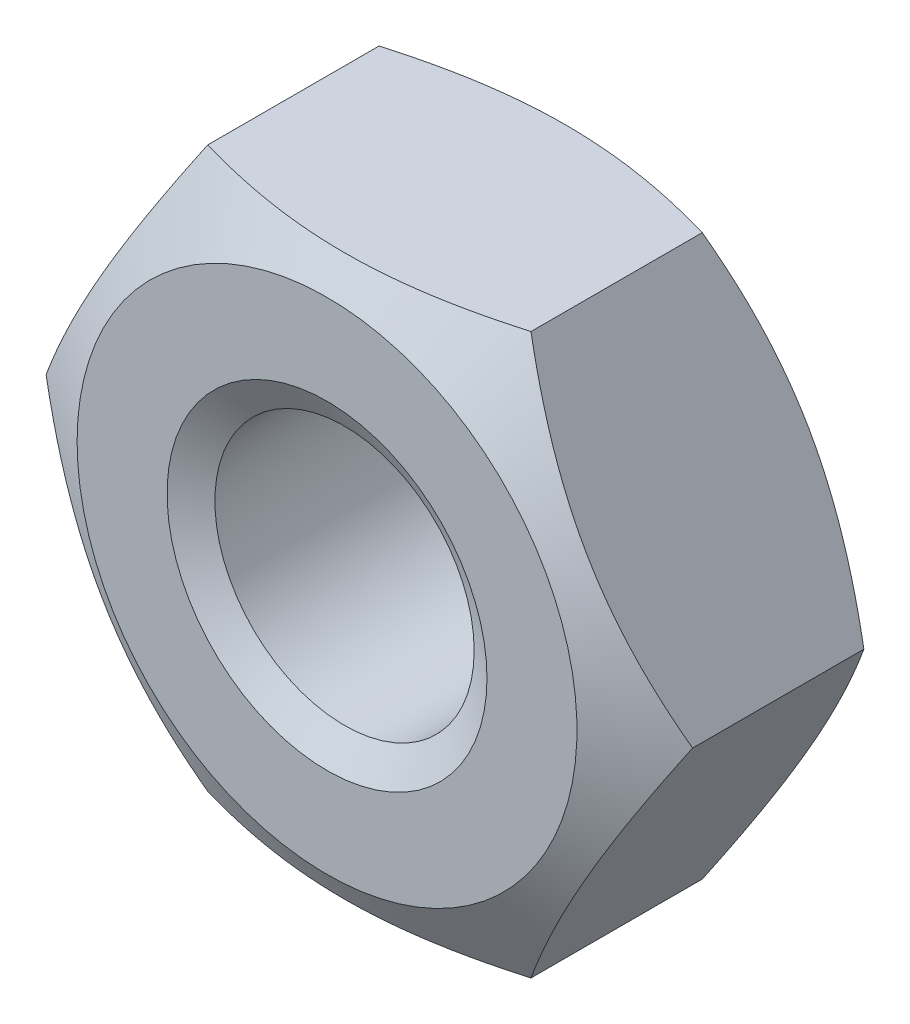
ISO-10303-21;
HEADER;
FILE_DESCRIPTION(('STEP AP214'),'2;1');
FILE_NAME('part.step','',(''),(''),'','','');
FILE_SCHEMA(('AUTOMOTIVE_DESIGN { 1 0 10303 214 1 1 1 1 }'));
ENDSEC;
DATA;
#1=APPLICATION_CONTEXT('core data for automotive mechanical design processes');
#2=APPLICATION_PROTOCOL_DEFINITION('international standard','automotive_design',2000,#1);
#3=PRODUCT_CONTEXT('',#1,'mechanical');
#4=PRODUCT('Part','Part','',(#3));
#5=PRODUCT_RELATED_PRODUCT_CATEGORY('part','',(#4));
#6=PRODUCT_DEFINITION_FORMATION('','',#4);
#7=PRODUCT_DEFINITION_CONTEXT('part definition',#1,'design');
#8=PRODUCT_DEFINITION('design','',#6,#7);
#9=PRODUCT_DEFINITION_SHAPE('','',#8);
#10=(LENGTH_UNIT() NAMED_UNIT(*) SI_UNIT(.MILLI.,.METRE.));
#11=(NAMED_UNIT(*) PLANE_ANGLE_UNIT() SI_UNIT($,.RADIAN.));
#12=(NAMED_UNIT(*) SI_UNIT($,.STERADIAN.) SOLID_ANGLE_UNIT());
#13=UNCERTAINTY_MEASURE_WITH_UNIT(LENGTH_MEASURE(1.E-05),#10,'distance_accuracy_value','');
#14=(GEOMETRIC_REPRESENTATION_CONTEXT(3) GLOBAL_UNCERTAINTY_ASSIGNED_CONTEXT((#13)) GLOBAL_UNIT_ASSIGNED_CONTEXT((#10,
#11,#12)) REPRESENTATION_CONTEXT('',''));
#15=CARTESIAN_POINT('',(0.,0.,0.));
#16=DIRECTION('',(0.,0.,1.));
#17=DIRECTION('',(1.,0.,0.));
#18=AXIS2_PLACEMENT_3D('',#15,#16,#17);
#19=CARTESIAN_POINT('',(2.02072594216369,-3.5,-3.2));
#20=DIRECTION('',(0.866025403784439,-0.5,0.));
#21=DIRECTION('',(0.5,0.866025403784439,0.));
#22=AXIS2_PLACEMENT_3D('',#19,#20,#21);
#23=PLANE('',#22);
#24=CARTESIAN_POINT('',(2.02061047210985,-3.5002,-0.529180411639473));
#25=CARTESIAN_POINT('',(2.10941108799267,-3.34639282154755,-0.477892139936086));
#26=CARTESIAN_POINT('',(2.19897822522909,-3.19125798916558,-0.4312473047623));
#27=CARTESIAN_POINT('',(2.37966345361545,-2.87830199342322,-0.349828226479453));
#28=CARTESIAN_POINT('',(2.47078475532382,-2.72047526921251,-0.315082786530666));
#29=CARTESIAN_POINT('',(2.65189807961073,-2.40677778961987,-0.260996378128941));
#30=CARTESIAN_POINT('',(2.74186223545399,-2.25095530083931,-0.241295437206487));
#31=CARTESIAN_POINT('',(2.92221386641055,-1.93857711279463,-0.21777648368336));
#32=CARTESIAN_POINT('',(3.01260068598001,-1.78202254896577,-0.213938995491671));
#33=CARTESIAN_POINT('',(3.1814939814933,-1.48949078007901,-0.221921652823083));
#34=CARTESIAN_POINT('',(3.26002573814992,-1.3534697875421,-0.231781785015712));
#35=CARTESIAN_POINT('',(3.41657761679353,-1.08231397971101,-0.263032817845508));
#36=CARTESIAN_POINT('',(3.49459719728457,-0.947180102315318,-0.284434394231903));
#37=CARTESIAN_POINT('',(3.65147186489428,-0.675465207594817,-0.337936758826681));
#38=CARTESIAN_POINT('',(3.73030709667643,-0.538918580721665,-0.37026434539119));
#39=CARTESIAN_POINT('',(3.88680174018324,-0.267861907055499,-0.443635284754097));
#40=CARTESIAN_POINT('',(3.96446315689009,-0.133348387531463,-0.484661397515969));
#41=CARTESIAN_POINT('',(4.04156735438122,0.000200000000000456,-0.529180411639473));
#42=B_SPLINE_CURVE_WITH_KNOTS('',3,(#24,#25,#26,#27,#28,#29,#30,#31,#32,#33,#34,#35,#36,#37,#38,
#39,#40,#41),.UNSPECIFIED.,.F.,.F.,(4,2,2,2,2,2,2,2,4),(0.,0.554793832886253,1.11092123814983,
1.65328467083218,2.19498204478403,2.6666513085086,3.13875761298267,3.62133612600509,
4.10296698719187),.UNSPECIFIED.);
#43=CARTESIAN_POINT('',(2.0207259421637,-3.5,-0.529113742115747));
#44=VERTEX_POINT('',#43);
#45=CARTESIAN_POINT('',(4.04145188432738,0.,-0.529113742115747));
#46=VERTEX_POINT('',#45);
#47=EDGE_CURVE('E52',#44,#46,#42,.T.);
#48=ORIENTED_EDGE('',*,*,#47,.F.);
#49=DIRECTION('',(0.,0.,1.));
#50=VECTOR('',#49,1.);
#51=CARTESIAN_POINT('',(2.02072594216369,-3.5,-3.2));
#52=LINE('',#51,#50);
#53=CARTESIAN_POINT('',(2.0207259421637,-3.5,-2.67088625788425));
#54=VERTEX_POINT('',#53);
#55=EDGE_CURVE('E116',#54,#44,#52,.T.);
#56=ORIENTED_EDGE('',*,*,#55,.F.);
#57=CARTESIAN_POINT('',(4.04156735438122,0.000200000000000645,-2.67081958836053));
#58=CARTESIAN_POINT('',(3.9527667384984,-0.153607178452449,-2.72210786006391));
#59=CARTESIAN_POINT('',(3.86319960126198,-0.308742010834423,-2.7687526952377));
#60=CARTESIAN_POINT('',(3.68251437287562,-0.62169800657678,-2.85017177352055));
#61=CARTESIAN_POINT('',(3.59139307116725,-0.779524730787494,-2.88491721346933));
#62=CARTESIAN_POINT('',(3.41027974688034,-1.09322221038013,-2.93900362187106));
#63=CARTESIAN_POINT('',(3.32031559103708,-1.24904469916069,-2.95870456279351));
#64=CARTESIAN_POINT('',(3.13996396008051,-1.56142288720537,-2.98222351631664));
#65=CARTESIAN_POINT('',(3.04957714051106,-1.71797745103423,-2.98606100450833));
#66=CARTESIAN_POINT('',(2.88068384499777,-2.01050921992099,-2.97807834717692));
#67=CARTESIAN_POINT('',(2.80215208834114,-2.1465302124579,-2.96821821498429));
#68=CARTESIAN_POINT('',(2.64560020969753,-2.41768602028899,-2.93696718215449));
#69=CARTESIAN_POINT('',(2.5675806292065,-2.55281989768468,-2.9155656057681));
#70=CARTESIAN_POINT('',(2.41070596159678,-2.82453479240518,-2.86206324117332));
#71=CARTESIAN_POINT('',(2.33187072981463,-2.96108141927834,-2.82973565460881));
#72=CARTESIAN_POINT('',(2.17537608630783,-3.2321380929445,-2.7563647152459));
#73=CARTESIAN_POINT('',(2.09771466960098,-3.36665161246854,-2.71533860248403));
#74=CARTESIAN_POINT('',(2.02061047210985,-3.5002,-2.67081958836053));
#75=B_SPLINE_CURVE_WITH_KNOTS('',3,(#57,#58,#59,#60,#61,#62,#63,#64,#65,#66,#67,#68,#69,#70,#71,
#72,#73,#74),.UNSPECIFIED.,.F.,.F.,(4,2,2,2,2,2,2,2,4),(0.,0.554793832886253,1.11092123814983,
1.65328467083218,2.19498204478403,2.6666513085086,3.13875761298267,3.6213361260051,
4.10296698719187),.UNSPECIFIED.);
#76=CARTESIAN_POINT('',(4.04145188432738,0.,-2.67088625788425));
#77=VERTEX_POINT('',#76);
#78=EDGE_CURVE('E127',#77,#54,#75,.T.);
#79=ORIENTED_EDGE('',*,*,#78,.F.);
#80=DIRECTION('',(0.,0.,1.));
#81=VECTOR('',#80,1.);
#82=CARTESIAN_POINT('',(4.04145188432738,0.,-3.2));
#83=LINE('',#82,#81);
#84=EDGE_CURVE('E124',#77,#46,#83,.T.);
#85=ORIENTED_EDGE('',*,*,#84,.T.);
#86=EDGE_LOOP('',(#48,#56,#79,#85));
#87=FACE_BOUND('',#86,.T.);
#88=ADVANCED_FACE('F37',(#87),#23,.T.);
#89=CARTESIAN_POINT('',(-2.02072594216369,-3.5,-3.2));
#90=DIRECTION('',(0.,-1.,0.));
#91=DIRECTION('',(0.,0.,-1.));
#92=AXIS2_PLACEMENT_3D('',#89,#90,#91);
#93=PLANE('',#92);
#94=CARTESIAN_POINT('',(-5.32929161654317,-3.5,-1.87687395708917));
#95=CARTESIAN_POINT('',(-5.17721390419067,-3.5,-1.80350487565994));
#96=CARTESIAN_POINT('',(-5.02477626878264,-3.5,-1.73086848506458));
#97=CARTESIAN_POINT('',(-4.71898932740942,-3.5,-1.58747532667976));
#98=CARTESIAN_POINT('',(-4.56563987275511,-3.5,-1.51671887634277));
#99=CARTESIAN_POINT('',(-4.25699896893402,-3.5,-1.37712246688467));
#100=CARTESIAN_POINT('',(-4.10170141817195,-3.5,-1.30829594937782));
#101=CARTESIAN_POINT('',(-3.78983593684866,-3.5,-1.17359495846103));
#102=CARTESIAN_POINT('',(-3.63326806987044,-3.5,-1.10772033836364));
#103=CARTESIAN_POINT('',(-3.31397317950403,-3.5,-0.977818284434954));
#104=CARTESIAN_POINT('',(-3.1512005381005,-3.5,-0.913902341259745));
#105=CARTESIAN_POINT('',(-2.82371486391853,-3.5,-0.79115117758084));
#106=CARTESIAN_POINT('',(-2.65900161073452,-3.5,-0.732316540634471));
#107=CARTESIAN_POINT('',(-2.32771428220496,-3.5,-0.621345152712524));
#108=CARTESIAN_POINT('',(-2.16114510128922,-3.5,-0.569193942658812));
#109=CARTESIAN_POINT('',(-1.82562056548841,-3.5,-0.473327366020735));
#110=CARTESIAN_POINT('',(-1.65666601191436,-3.5,-0.429609235646829));
#111=CARTESIAN_POINT('',(-1.31718369019152,-3.5,-0.352994778610104));
#112=CARTESIAN_POINT('',(-1.14666839877701,-3.5,-0.320044212866405));
#113=CARTESIAN_POINT('',(-0.803625193118966,-3.5,-0.266896804969145));
#114=CARTESIAN_POINT('',(-0.631097439625843,-3.5,-0.246698951170405));
#115=CARTESIAN_POINT('',(-0.28710102571895,-3.5,-0.220933629162163));
#116=CARTESIAN_POINT('',(-0.115646203361172,-3.5,-0.215185920399921));
#117=CARTESIAN_POINT('',(0.227139625218219,-3.5,-0.218339385870476));
#118=CARTESIAN_POINT('',(0.398470626767779,-3.5,-0.227241086659771));
#119=CARTESIAN_POINT('',(0.692349454668638,-3.5,-0.254460230236954));
#120=CARTESIAN_POINT('',(0.815219779623653,-3.5,-0.269472731531103));
#121=CARTESIAN_POINT('',(1.05998960023957,-3.5,-0.306041966480247));
#122=CARTESIAN_POINT('',(1.18188894833212,-3.5,-0.327599676106086));
#123=CARTESIAN_POINT('',(1.54600794183218,-3.5,-0.400949728847912));
#124=CARTESIAN_POINT('',(1.78649842940784,-3.5,-0.461403324209748));
#125=CARTESIAN_POINT('',(2.14599672793668,-3.5,-0.565325828456278));
#126=CARTESIAN_POINT('',(2.26688905461166,-3.5,-0.602639268070146));
#127=CARTESIAN_POINT('',(2.50749825220121,-3.5,-0.680914127688239));
#128=CARTESIAN_POINT('',(2.62721511556065,-3.5,-0.721875571122514));
#129=CARTESIAN_POINT('',(2.86551603325762,-3.5,-0.806808159344165));
#130=CARTESIAN_POINT('',(2.98410049564077,-3.5,-0.850778169507659));
#131=CARTESIAN_POINT('',(3.22030222157322,-3.5,-0.941233650119845));
#132=CARTESIAN_POINT('',(3.3379194941164,-3.5,-0.987719097146951));
#133=CARTESIAN_POINT('',(3.60516917076278,-3.5,-1.0961149969147));
#134=CARTESIAN_POINT('',(3.75452937337451,-3.5,-1.15869521360348));
#135=CARTESIAN_POINT('',(4.05207329899395,-3.5,-1.28659848230968));
#136=CARTESIAN_POINT('',(4.20025696630694,-3.5,-1.35192166326358));
#137=CARTESIAN_POINT('',(4.64337511466969,-3.5,-1.55119395905422));
#138=CARTESIAN_POINT('',(4.93683132147272,-3.5,-1.68842699826337));
#139=CARTESIAN_POINT('',(5.52118834963182,-3.5,-1.96881056529261));
#140=CARTESIAN_POINT('',(5.81208673092351,-3.5,-2.11196612775264));
#141=CARTESIAN_POINT('',(6.39186182499708,-3.5,-2.40232740634392));
#142=CARTESIAN_POINT('',(6.68073847267516,-3.5,-2.54953325215636));
#143=CARTESIAN_POINT('',(7.23458971232226,-3.5,-2.83528891126869));
#144=CARTESIAN_POINT('',(7.49967651839816,-3.5,-2.97362193479787));
#145=CARTESIAN_POINT('',(8.02887233478434,-3.5,-3.25216194114253));
#146=CARTESIAN_POINT('',(8.29298131705417,-3.5,-3.39236897717446));
#147=CARTESIAN_POINT('',(8.81986478760678,-3.5,-3.67392059382426));
#148=CARTESIAN_POINT('',(9.08264092219005,-3.5,-3.81526209803125));
#149=CARTESIAN_POINT('',(9.60756200304195,-3.5,-4.09908318288291));
#150=CARTESIAN_POINT('',(9.86970697868872,-3.5,-4.24156270916979));
#151=CARTESIAN_POINT('',(10.1316166656453,-3.5,-4.384470530275));
#152=B_SPLINE_CURVE_WITH_KNOTS('',3,(#94,#95,#96,#97,#98,#99,#100,#101,#102,#103,#104,#105,#106,
#107,#108,#109,#110,#111,#112,#113,#114,#115,#116,#117,#118,#119,#120,#121,#122,#123,#124,#125,
#126,#127,#128,#129,#130,#131,#132,#133,#134,#135,#136,#137,#138,#139,#140,#141,#142,#143,#144,
#145,#146,#147,#148,#149,#150,#151),.UNSPECIFIED.,.F.,.F.,(4,2,2,2,2,2,2,2,2,2,2,2,2,2,2,2,2,2,
2,2,2,2,2,2,2,2,2,2,4),(0.,0.506559628513161,1.01320425947753,1.52277737705162,2.03232514446701,
2.55687533859891,3.08148569426823,3.60494121554562,4.12822489117061,4.64883048977565,
5.16939478466903,5.68343298488776,6.19748966203318,6.56865983361145,6.93988537841949,
7.68278720969736,8.06231738593603,8.44184999996057,8.82124026108465,9.20062699026042,
9.68641258908992,10.1722210484987,11.143985405014,12.1165935360882,13.0892328442636,
13.986254382616,14.8833014480957,15.7784288466341,16.673513741979),.UNSPECIFIED.);
#153=CARTESIAN_POINT('',(-2.02072594216369,-3.5,-0.529113742115747));
#154=VERTEX_POINT('',#153);
#155=EDGE_CURVE('E109',#154,#44,#152,.T.);
#156=ORIENTED_EDGE('',*,*,#155,.F.);
#157=DIRECTION('',(0.,0.,1.));
#158=VECTOR('',#157,1.);
#159=CARTESIAN_POINT('',(-2.02072594216369,-3.5,-3.2));
#160=LINE('',#159,#158);
#161=CARTESIAN_POINT('',(-2.02072594216369,-3.5,-2.67088625788425));
#162=VERTEX_POINT('',#161);
#163=EDGE_CURVE('E108',#162,#154,#160,.T.);
#164=ORIENTED_EDGE('',*,*,#163,.F.);
#165=CARTESIAN_POINT('',(-5.32929161654317,-3.5,-1.32312604291083));
#166=CARTESIAN_POINT('',(-5.17721390419067,-3.5,-1.39649512434006));
#167=CARTESIAN_POINT('',(-5.02477626878264,-3.5,-1.46913151493542));
#168=CARTESIAN_POINT('',(-4.71898932740942,-3.5,-1.61252467332024));
#169=CARTESIAN_POINT('',(-4.56563987275511,-3.5,-1.68328112365723));
#170=CARTESIAN_POINT('',(-4.25699896893402,-3.5,-1.82287753311533));
#171=CARTESIAN_POINT('',(-4.10170141817195,-3.5,-1.89170405062218));
#172=CARTESIAN_POINT('',(-3.78983593684866,-3.5,-2.02640504153897));
#173=CARTESIAN_POINT('',(-3.63326806987044,-3.5,-2.09227966163636));
#174=CARTESIAN_POINT('',(-3.31397317950403,-3.5,-2.22218171556505));
#175=CARTESIAN_POINT('',(-3.1512005381005,-3.5,-2.28609765874026));
#176=CARTESIAN_POINT('',(-2.82371486391853,-3.5,-2.40884882241916));
#177=CARTESIAN_POINT('',(-2.65900161073452,-3.5,-2.46768345936553));
#178=CARTESIAN_POINT('',(-2.32771428220496,-3.5,-2.57865484728748));
#179=CARTESIAN_POINT('',(-2.16114510128922,-3.5,-2.63080605734119));
#180=CARTESIAN_POINT('',(-1.82562056548841,-3.5,-2.72667263397926));
#181=CARTESIAN_POINT('',(-1.65666601191436,-3.5,-2.77039076435317));
#182=CARTESIAN_POINT('',(-1.31718369019152,-3.5,-2.8470052213899));
#183=CARTESIAN_POINT('',(-1.14666839877701,-3.5,-2.8799557871336));
#184=CARTESIAN_POINT('',(-0.803625193118966,-3.5,-2.93310319503086));
#185=CARTESIAN_POINT('',(-0.631097439625843,-3.5,-2.9533010488296));
#186=CARTESIAN_POINT('',(-0.287101025718951,-3.5,-2.97906637083784));
#187=CARTESIAN_POINT('',(-0.115646203361172,-3.5,-2.98481407960008));
#188=CARTESIAN_POINT('',(0.227139625218219,-3.5,-2.98166061412952));
#189=CARTESIAN_POINT('',(0.398470626767779,-3.5,-2.97275891334023));
#190=CARTESIAN_POINT('',(0.692349454668638,-3.5,-2.94553976976305));
#191=CARTESIAN_POINT('',(0.815219779623654,-3.5,-2.9305272684689));
#192=CARTESIAN_POINT('',(1.05998960023957,-3.5,-2.89395803351975));
#193=CARTESIAN_POINT('',(1.18188894833212,-3.5,-2.87240032389391));
#194=CARTESIAN_POINT('',(1.54600794183218,-3.5,-2.79905027115209));
#195=CARTESIAN_POINT('',(1.78649842940784,-3.5,-2.73859667579025));
#196=CARTESIAN_POINT('',(2.14599672793668,-3.5,-2.63467417154372));
#197=CARTESIAN_POINT('',(2.26688905461166,-3.5,-2.59736073192985));
#198=CARTESIAN_POINT('',(2.50749825220121,-3.5,-2.51908587231176));
#199=CARTESIAN_POINT('',(2.62721511556065,-3.5,-2.47812442887749));
#200=CARTESIAN_POINT('',(2.86551603325762,-3.5,-2.39319184065584));
#201=CARTESIAN_POINT('',(2.98410049564077,-3.5,-2.34922183049234));
#202=CARTESIAN_POINT('',(3.22030222157322,-3.5,-2.25876634988016));
#203=CARTESIAN_POINT('',(3.3379194941164,-3.5,-2.21228090285305));
#204=CARTESIAN_POINT('',(3.60516917076278,-3.5,-2.1038850030853));
#205=CARTESIAN_POINT('',(3.75452937337451,-3.5,-2.04130478639653));
#206=CARTESIAN_POINT('',(4.05207329899395,-3.5,-1.91340151769032));
#207=CARTESIAN_POINT('',(4.20025696630694,-3.5,-1.84807833673642));
#208=CARTESIAN_POINT('',(4.64337511466969,-3.5,-1.64880604094578));
#209=CARTESIAN_POINT('',(4.93683132147271,-3.5,-1.51157300173663));
#210=CARTESIAN_POINT('',(5.52118834963182,-3.5,-1.23118943470739));
#211=CARTESIAN_POINT('',(5.81208673092351,-3.5,-1.08803387224736));
#212=CARTESIAN_POINT('',(6.39186182499708,-3.5,-0.797672593656079));
#213=CARTESIAN_POINT('',(6.68073847267516,-3.5,-0.65046674784364));
#214=CARTESIAN_POINT('',(7.23458971232226,-3.5,-0.364711088731306));
#215=CARTESIAN_POINT('',(7.49967651839816,-3.5,-0.226378065202127));
#216=CARTESIAN_POINT('',(8.02887233478434,-3.5,0.05216194114253));
#217=CARTESIAN_POINT('',(8.29298131705417,-3.5,0.192368977174463));
#218=CARTESIAN_POINT('',(8.81986478760678,-3.5,0.473920593824257));
#219=CARTESIAN_POINT('',(9.08264092219005,-3.5,0.615262098031252));
#220=CARTESIAN_POINT('',(9.60756200304195,-3.5,0.899083182882905));
#221=CARTESIAN_POINT('',(9.86970697868872,-3.5,1.04156270916979));
#222=CARTESIAN_POINT('',(10.1316166656453,-3.5,1.184470530275));
#223=B_SPLINE_CURVE_WITH_KNOTS('',3,(#165,#166,#167,#168,#169,#170,#171,#172,#173,#174,#175,
#176,#177,#178,#179,#180,#181,#182,#183,#184,#185,#186,#187,#188,#189,#190,#191,#192,#193,#194,
#195,#196,#197,#198,#199,#200,#201,#202,#203,#204,#205,#206,#207,#208,#209,#210,#211,#212,#213,
#214,#215,#216,#217,#218,#219,#220,#221,#222),.UNSPECIFIED.,.F.,.F.,(4,2,2,2,2,2,2,2,2,2,2,2,2,
2,2,2,2,2,2,2,2,2,2,2,2,2,2,2,4),(0.,0.506559628513161,1.01320425947753,1.52277737705162,
2.03232514446701,2.55687533859891,3.08148569426823,3.60494121554561,4.12822489117061,
4.64883048977565,5.16939478466903,5.68343298488776,6.19748966203318,6.56865983361145,
6.93988537841949,7.68278720969736,8.06231738593602,8.44184999996057,8.82124026108465,
9.20062699026042,9.68641258908991,10.1722210484987,11.143985405014,12.1165935360882,
13.0892328442636,13.986254382616,14.8833014480957,15.7784288466341,16.673513741979),.UNSPECIFIED.);
#224=EDGE_CURVE('E203',#54,#162,#223,.F.);
#225=ORIENTED_EDGE('',*,*,#224,.F.);
#226=ORIENTED_EDGE('',*,*,#55,.T.);
#227=EDGE_LOOP('',(#156,#164,#225,#226));
#228=FACE_BOUND('',#227,.T.);
#229=ADVANCED_FACE('F213',(#228),#93,.T.);
#230=CARTESIAN_POINT('',(-4.04145188432738,0.,-3.2));
#231=DIRECTION('',(-0.866025403784439,-0.5,0.));
#232=DIRECTION('',(0.5,-0.866025403784439,0.));
#233=AXIS2_PLACEMENT_3D('',#230,#231,#232);
#234=PLANE('',#233);
#235=CARTESIAN_POINT('',(-4.04156735438122,0.000200000000001303,-0.529180411639475));
#236=CARTESIAN_POINT('',(-3.9527667384984,-0.153607178452448,-0.477892139936088));
#237=CARTESIAN_POINT('',(-3.86319960126198,-0.308742010834423,-0.431247304762302));
#238=CARTESIAN_POINT('',(-3.68251437287562,-0.62169800657678,-0.349828226479454));
#239=CARTESIAN_POINT('',(-3.59139307116725,-0.779524730787494,-0.315082786530667));
#240=CARTESIAN_POINT('',(-3.41027974688034,-1.09322221038013,-0.260996378128943));
#241=CARTESIAN_POINT('',(-3.32031559103708,-1.24904469916069,-0.241295437206488));
#242=CARTESIAN_POINT('',(-3.13996396008052,-1.56142288720537,-0.217776483683361));
#243=CARTESIAN_POINT('',(-3.04957714051106,-1.71797745103423,-0.213938995491672));
#244=CARTESIAN_POINT('',(-2.88068384499778,-2.01050921992099,-0.221921652823084));
#245=CARTESIAN_POINT('',(-2.80215208834115,-2.1465302124579,-0.231781785015713));
#246=CARTESIAN_POINT('',(-2.64560020969754,-2.41768602028899,-0.263032817845509));
#247=CARTESIAN_POINT('',(-2.5675806292065,-2.55281989768468,-0.284434394231903));
#248=CARTESIAN_POINT('',(-2.41070596159679,-2.82453479240518,-0.337936758826682));
#249=CARTESIAN_POINT('',(-2.33187072981464,-2.96108141927833,-0.370264345391191));
#250=CARTESIAN_POINT('',(-2.17537608630783,-3.2321380929445,-0.443635284754098));
#251=CARTESIAN_POINT('',(-2.09771466960098,-3.36665161246854,-0.48466139751597));
#252=CARTESIAN_POINT('',(-2.02061047210985,-3.5002,-0.529180411639473));
#253=B_SPLINE_CURVE_WITH_KNOTS('',3,(#235,#236,#237,#238,#239,#240,#241,#242,#243,#244,#245,
#246,#247,#248,#249,#250,#251,#252),.UNSPECIFIED.,.F.,.F.,(4,2,2,2,2,2,2,2,4),(0.,
0.554793832886253,1.11092123814984,1.65328467083219,2.19498204478403,2.6666513085086,
3.13875761298267,3.6213361260051,4.10296698719187),.UNSPECIFIED.);
#254=CARTESIAN_POINT('',(-4.04145188432738,0.,-0.529113742115747));
#255=VERTEX_POINT('',#254);
#256=EDGE_CURVE('E92',#255,#154,#253,.T.);
#257=ORIENTED_EDGE('',*,*,#256,.F.);
#258=DIRECTION('',(0.,0.,1.));
#259=VECTOR('',#258,1.);
#260=CARTESIAN_POINT('',(-4.04145188432738,0.,-3.2));
#261=LINE('',#260,#259);
#262=CARTESIAN_POINT('',(-4.04145188432738,0.,-2.67088625788425));
#263=VERTEX_POINT('',#262);
#264=EDGE_CURVE('E106',#263,#255,#261,.T.);
#265=ORIENTED_EDGE('',*,*,#264,.F.);
#266=CARTESIAN_POINT('',(-2.02061047210985,-3.5002,-2.67081958836053));
#267=CARTESIAN_POINT('',(-2.10941108799267,-3.34639282154755,-2.72210786006391));
#268=CARTESIAN_POINT('',(-2.19897822522909,-3.19125798916558,-2.7687526952377));
#269=CARTESIAN_POINT('',(-2.37966345361545,-2.87830199342322,-2.85017177352055));
#270=CARTESIAN_POINT('',(-2.47078475532382,-2.7204752692125,-2.88491721346933));
#271=CARTESIAN_POINT('',(-2.65189807961073,-2.40677778961987,-2.93900362187106));
#272=CARTESIAN_POINT('',(-2.74186223545399,-2.25095530083931,-2.95870456279351));
#273=CARTESIAN_POINT('',(-2.92221386641056,-1.93857711279463,-2.98222351631664));
#274=CARTESIAN_POINT('',(-3.01260068598001,-1.78202254896577,-2.98606100450833));
#275=CARTESIAN_POINT('',(-3.1814939814933,-1.48949078007901,-2.97807834717692));
#276=CARTESIAN_POINT('',(-3.26002573814993,-1.3534697875421,-2.96821821498429));
#277=CARTESIAN_POINT('',(-3.41657761679354,-1.08231397971101,-2.93696718215449));
#278=CARTESIAN_POINT('',(-3.49459719728458,-0.947180102315318,-2.9155656057681));
#279=CARTESIAN_POINT('',(-3.65147186489429,-0.675465207594816,-2.86206324117332));
#280=CARTESIAN_POINT('',(-3.73030709667644,-0.538918580721664,-2.82973565460881));
#281=CARTESIAN_POINT('',(-3.88680174018324,-0.267861907055498,-2.7563647152459));
#282=CARTESIAN_POINT('',(-3.96446315689009,-0.133348387531462,-2.71533860248403));
#283=CARTESIAN_POINT('',(-4.04156735438122,0.000200000000001482,-2.67081958836053));
#284=B_SPLINE_CURVE_WITH_KNOTS('',3,(#266,#267,#268,#269,#270,#271,#272,#273,#274,#275,#276,
#277,#278,#279,#280,#281,#282,#283),.UNSPECIFIED.,.F.,.F.,(4,2,2,2,2,2,2,2,4),(0.,
0.554793832886253,1.11092123814983,1.65328467083218,2.19498204478403,2.6666513085086,
3.13875761298267,3.6213361260051,4.10296698719187),.UNSPECIFIED.);
#285=EDGE_CURVE('E196',#162,#263,#284,.T.);
#286=ORIENTED_EDGE('',*,*,#285,.F.);
#287=ORIENTED_EDGE('',*,*,#163,.T.);
#288=EDGE_LOOP('',(#257,#265,#286,#287));
#289=FACE_BOUND('',#288,.T.);
#290=ADVANCED_FACE('F104',(#289),#234,.T.);
#291=CARTESIAN_POINT('',(-2.02072594216369,3.5,-3.2));
#292=DIRECTION('',(-0.866025403784438,0.5,0.));
#293=DIRECTION('',(-0.5,-0.866025403784439,0.));
#294=AXIS2_PLACEMENT_3D('',#291,#292,#293);
#295=PLANE('',#294);
#296=CARTESIAN_POINT('',(-2.02061047210985,3.5002,-0.529180411639474));
#297=CARTESIAN_POINT('',(-2.10941108799267,3.34639282154755,-0.477892139936087));
#298=CARTESIAN_POINT('',(-2.19897822522909,3.19125798916558,-0.431247304762301));
#299=CARTESIAN_POINT('',(-2.37966345361545,2.87830199342322,-0.349828226479454));
#300=CARTESIAN_POINT('',(-2.47078475532382,2.72047526921251,-0.315082786530668));
#301=CARTESIAN_POINT('',(-2.65189807961074,2.40677778961987,-0.260996378128943));
#302=CARTESIAN_POINT('',(-2.74186223545399,2.25095530083931,-0.241295437206488));
#303=CARTESIAN_POINT('',(-2.92221386641056,1.93857711279463,-0.217776483683361));
#304=CARTESIAN_POINT('',(-3.01260068598001,1.78202254896577,-0.213938995491673));
#305=CARTESIAN_POINT('',(-3.1814939814933,1.48949078007901,-0.221921652823085));
#306=CARTESIAN_POINT('',(-3.26002573814993,1.3534697875421,-0.231781785015714));
#307=CARTESIAN_POINT('',(-3.41657761679354,1.08231397971101,-0.26303281784551));
#308=CARTESIAN_POINT('',(-3.49459719728458,0.947180102315319,-0.284434394231905));
#309=CARTESIAN_POINT('',(-3.65147186489429,0.675465207594818,-0.337936758826683));
#310=CARTESIAN_POINT('',(-3.73030709667644,0.538918580721666,-0.370264345391192));
#311=CARTESIAN_POINT('',(-3.88680174018324,0.2678619070555,-0.443635284754099));
#312=CARTESIAN_POINT('',(-3.96446315689009,0.133348387531465,-0.484661397515971));
#313=CARTESIAN_POINT('',(-4.04156735438122,-0.000199999999998752,-0.529180411639475));
#314=B_SPLINE_CURVE_WITH_KNOTS('',3,(#296,#297,#298,#299,#300,#301,#302,#303,#304,#305,#306,
#307,#308,#309,#310,#311,#312,#313),.UNSPECIFIED.,.F.,.F.,(4,2,2,2,2,2,2,2,4),(0.,
0.554793832886253,1.11092123814984,1.65328467083218,2.19498204478403,2.6666513085086,
3.13875761298267,3.62133612600509,4.10296698719187),.UNSPECIFIED.);
#315=CARTESIAN_POINT('',(-2.02072594216369,3.5,-0.529113742115747));
#316=VERTEX_POINT('',#315);
#317=EDGE_CURVE('E88',#316,#255,#314,.T.);
#318=ORIENTED_EDGE('',*,*,#317,.F.);
#319=DIRECTION('',(0.,0.,1.));
#320=VECTOR('',#319,1.);
#321=CARTESIAN_POINT('',(-2.02072594216369,3.5,-3.2));
#322=LINE('',#321,#320);
#323=CARTESIAN_POINT('',(-2.02072594216369,3.5,-2.67088625788425));
#324=VERTEX_POINT('',#323);
#325=EDGE_CURVE('E114',#324,#316,#322,.T.);
#326=ORIENTED_EDGE('',*,*,#325,.F.);
#327=CARTESIAN_POINT('',(-4.04156735438122,-0.00019999999999875,-2.67081958836053));
#328=CARTESIAN_POINT('',(-3.9527667384984,0.153607178452451,-2.72210786006391));
#329=CARTESIAN_POINT('',(-3.86319960126198,0.308742010834425,-2.7687526952377));
#330=CARTESIAN_POINT('',(-3.68251437287562,0.621698006576782,-2.85017177352055));
#331=CARTESIAN_POINT('',(-3.59139307116725,0.779524730787497,-2.88491721346933));
#332=CARTESIAN_POINT('',(-3.41027974688034,1.09322221038013,-2.93900362187106));
#333=CARTESIAN_POINT('',(-3.32031559103708,1.24904469916069,-2.95870456279351));
#334=CARTESIAN_POINT('',(-3.13996396008052,1.56142288720537,-2.98222351631664));
#335=CARTESIAN_POINT('',(-3.04957714051106,1.71797745103423,-2.98606100450833));
#336=CARTESIAN_POINT('',(-2.88068384499778,2.01050921992099,-2.97807834717692));
#337=CARTESIAN_POINT('',(-2.80215208834115,2.14653021245791,-2.96821821498429));
#338=CARTESIAN_POINT('',(-2.64560020969754,2.41768602028899,-2.93696718215449));
#339=CARTESIAN_POINT('',(-2.5675806292065,2.55281989768468,-2.9155656057681));
#340=CARTESIAN_POINT('',(-2.41070596159679,2.82453479240518,-2.86206324117332));
#341=CARTESIAN_POINT('',(-2.33187072981464,2.96108141927834,-2.82973565460881));
#342=CARTESIAN_POINT('',(-2.17537608630783,3.2321380929445,-2.7563647152459));
#343=CARTESIAN_POINT('',(-2.09771466960099,3.36665161246854,-2.71533860248403));
#344=CARTESIAN_POINT('',(-2.02061047210985,3.5002,-2.67081958836053));
#345=B_SPLINE_CURVE_WITH_KNOTS('',3,(#327,#328,#329,#330,#331,#332,#333,#334,#335,#336,#337,
#338,#339,#340,#341,#342,#343,#344),.UNSPECIFIED.,.F.,.F.,(4,2,2,2,2,2,2,2,4),(0.,
0.554793832886253,1.11092123814984,1.65328467083219,2.19498204478403,2.6666513085086,
3.13875761298267,3.62133612600509,4.10296698719187),.UNSPECIFIED.);
#346=EDGE_CURVE('E113',#263,#324,#345,.T.);
#347=ORIENTED_EDGE('',*,*,#346,.F.);
#348=ORIENTED_EDGE('',*,*,#264,.T.);
#349=EDGE_LOOP('',(#318,#326,#347,#348));
#350=FACE_BOUND('',#349,.T.);
#351=ADVANCED_FACE('F112',(#350),#295,.T.);
#352=CARTESIAN_POINT('',(2.02072594216369,3.5,-3.2));
#353=DIRECTION('',(0.,1.,0.));
#354=DIRECTION('',(0.,0.,1.));
#355=AXIS2_PLACEMENT_3D('',#352,#353,#354);
#356=PLANE('',#355);
#357=CARTESIAN_POINT('',(-5.32929161654318,3.5,-1.87687395708917));
#358=CARTESIAN_POINT('',(-5.17721390419067,3.5,-1.80350487565994));
#359=CARTESIAN_POINT('',(-5.02477626878264,3.5,-1.73086848506458));
#360=CARTESIAN_POINT('',(-4.71898932740942,3.5,-1.58747532667976));
#361=CARTESIAN_POINT('',(-4.56563987275511,3.5,-1.51671887634277));
#362=CARTESIAN_POINT('',(-4.25699896893402,3.5,-1.37712246688467));
#363=CARTESIAN_POINT('',(-4.10170141817195,3.5,-1.30829594937782));
#364=CARTESIAN_POINT('',(-3.78983593684866,3.5,-1.17359495846103));
#365=CARTESIAN_POINT('',(-3.63326806987044,3.5,-1.10772033836364));
#366=CARTESIAN_POINT('',(-3.31397317950403,3.5,-0.977818284434954));
#367=CARTESIAN_POINT('',(-3.1512005381005,3.5,-0.913902341259745));
#368=CARTESIAN_POINT('',(-2.82371486391854,3.5,-0.791151177580841));
#369=CARTESIAN_POINT('',(-2.65900161073452,3.5,-0.732316540634472));
#370=CARTESIAN_POINT('',(-2.32771428220496,3.5,-0.621345152712525));
#371=CARTESIAN_POINT('',(-2.16114510128923,3.5,-0.569193942658812));
#372=CARTESIAN_POINT('',(-1.82562056548841,3.5,-0.473327366020736));
#373=CARTESIAN_POINT('',(-1.65666601191436,3.5,-0.42960923564683));
#374=CARTESIAN_POINT('',(-1.31718369019152,3.5,-0.352994778610105));
#375=CARTESIAN_POINT('',(-1.14666839877701,3.5,-0.320044212866406));
#376=CARTESIAN_POINT('',(-0.803625193118967,3.5,-0.266896804969146));
#377=CARTESIAN_POINT('',(-0.631097439625844,3.5,-0.246698951170405));
#378=CARTESIAN_POINT('',(-0.287101025718951,3.5,-0.220933629162164));
#379=CARTESIAN_POINT('',(-0.115646203361172,3.5,-0.215185920399921));
#380=CARTESIAN_POINT('',(0.227139625218218,3.5,-0.218339385870476));
#381=CARTESIAN_POINT('',(0.398470626767778,3.5,-0.227241086659771));
#382=CARTESIAN_POINT('',(0.692349454668638,3.5,-0.254460230236955));
#383=CARTESIAN_POINT('',(0.815219779623653,3.5,-0.269472731531103));
#384=CARTESIAN_POINT('',(1.05998960023957,3.5,-0.306041966480247));
#385=CARTESIAN_POINT('',(1.18188894833212,3.5,-0.327599676106087));
#386=CARTESIAN_POINT('',(1.54600794183218,3.5,-0.400949728847912));
#387=CARTESIAN_POINT('',(1.78649842940784,3.5,-0.461403324209749));
#388=CARTESIAN_POINT('',(2.14599672793668,3.5,-0.565325828456279));
#389=CARTESIAN_POINT('',(2.26688905461166,3.5,-0.602639268070146));
#390=CARTESIAN_POINT('',(2.50749825220121,3.5,-0.680914127688239));
#391=CARTESIAN_POINT('',(2.62721511556065,3.5,-0.721875571122515));
#392=CARTESIAN_POINT('',(2.86551603325762,3.5,-0.806808159344166));
#393=CARTESIAN_POINT('',(2.98410049564077,3.5,-0.85077816950766));
#394=CARTESIAN_POINT('',(3.22030222157322,3.5,-0.941233650119846));
#395=CARTESIAN_POINT('',(3.33791949411641,3.5,-0.987719097146952));
#396=CARTESIAN_POINT('',(3.60516917076278,3.5,-1.0961149969147));
#397=CARTESIAN_POINT('',(3.75452937337451,3.5,-1.15869521360348));
#398=CARTESIAN_POINT('',(4.05207329899395,3.5,-1.28659848230968));
#399=CARTESIAN_POINT('',(4.20025696630694,3.5,-1.35192166326358));
#400=CARTESIAN_POINT('',(4.64337511466969,3.5,-1.55119395905422));
#401=CARTESIAN_POINT('',(4.93683132147271,3.5,-1.68842699826337));
#402=CARTESIAN_POINT('',(5.52118834963182,3.5,-1.96881056529261));
#403=CARTESIAN_POINT('',(5.81208673092351,3.5,-2.11196612775264));
#404=CARTESIAN_POINT('',(6.39186182499707,3.5,-2.40232740634392));
#405=CARTESIAN_POINT('',(6.68073847267516,3.5,-2.54953325215636));
#406=CARTESIAN_POINT('',(7.23458971232226,3.5,-2.83528891126869));
#407=CARTESIAN_POINT('',(7.49967651839815,3.5,-2.97362193479787));
#408=CARTESIAN_POINT('',(8.02887233478433,3.5,-3.25216194114253));
#409=CARTESIAN_POINT('',(8.29298131705417,3.5,-3.39236897717446));
#410=CARTESIAN_POINT('',(8.81986478760678,3.5,-3.67392059382426));
#411=CARTESIAN_POINT('',(9.08264092219005,3.5,-3.81526209803125));
#412=CARTESIAN_POINT('',(9.60756200304195,3.5,-4.09908318288291));
#413=CARTESIAN_POINT('',(9.86970697868872,3.5,-4.24156270916979));
#414=CARTESIAN_POINT('',(10.1316166656453,3.5,-4.384470530275));
#415=B_SPLINE_CURVE_WITH_KNOTS('',3,(#357,#358,#359,#360,#361,#362,#363,#364,#365,#366,#367,
#368,#369,#370,#371,#372,#373,#374,#375,#376,#377,#378,#379,#380,#381,#382,#383,#384,#385,#386,
#387,#388,#389,#390,#391,#392,#393,#394,#395,#396,#397,#398,#399,#400,#401,#402,#403,#404,#405,
#406,#407,#408,#409,#410,#411,#412,#413,#414),.UNSPECIFIED.,.F.,.F.,(4,2,2,2,2,2,2,2,2,2,2,2,2,
2,2,2,2,2,2,2,2,2,2,2,2,2,2,2,4),(0.,0.506559628513162,1.01320425947753,1.52277737705162,
2.03232514446701,2.55687533859891,3.08148569426823,3.60494121554562,4.12822489117061,
4.64883048977565,5.16939478466903,5.68343298488776,6.19748966203318,6.56865983361145,
6.9398853784195,7.68278720969736,8.06231738593603,8.44184999996057,8.82124026108466,
9.20062699026042,9.68641258908992,10.1722210484987,11.143985405014,12.1165935360882,
13.0892328442636,13.9862543826159,14.8833014480957,15.7784288466341,16.673513741979),.UNSPECIFIED.);
#416=CARTESIAN_POINT('',(2.02072594216368,3.50000000000001,-0.529113742115747));
#417=VERTEX_POINT('',#416);
#418=EDGE_CURVE('E95',#417,#316,#415,.F.);
#419=ORIENTED_EDGE('',*,*,#418,.F.);
#420=DIRECTION('',(0.,0.,1.));
#421=VECTOR('',#420,1.);
#422=CARTESIAN_POINT('',(2.02072594216369,3.5,-3.2));
#423=LINE('',#422,#421);
#424=CARTESIAN_POINT('',(2.02072594216369,3.5,-2.67088625788426));
#425=VERTEX_POINT('',#424);
#426=EDGE_CURVE('E118',#425,#417,#423,.T.);
#427=ORIENTED_EDGE('',*,*,#426,.F.);
#428=CARTESIAN_POINT('',(-5.32929161654318,3.5,-1.32312604291083));
#429=CARTESIAN_POINT('',(-5.17721390419067,3.5,-1.39649512434006));
#430=CARTESIAN_POINT('',(-5.02477626878264,3.5,-1.46913151493542));
#431=CARTESIAN_POINT('',(-4.71898932740942,3.5,-1.61252467332024));
#432=CARTESIAN_POINT('',(-4.56563987275511,3.5,-1.68328112365723));
#433=CARTESIAN_POINT('',(-4.25699896893402,3.5,-1.82287753311533));
#434=CARTESIAN_POINT('',(-4.10170141817195,3.5,-1.89170405062218));
#435=CARTESIAN_POINT('',(-3.78983593684866,3.5,-2.02640504153897));
#436=CARTESIAN_POINT('',(-3.63326806987044,3.5,-2.09227966163636));
#437=CARTESIAN_POINT('',(-3.31397317950403,3.5,-2.22218171556505));
#438=CARTESIAN_POINT('',(-3.1512005381005,3.5,-2.28609765874026));
#439=CARTESIAN_POINT('',(-2.82371486391854,3.5,-2.40884882241916));
#440=CARTESIAN_POINT('',(-2.65900161073452,3.5,-2.46768345936553));
#441=CARTESIAN_POINT('',(-2.32771428220496,3.5,-2.57865484728748));
#442=CARTESIAN_POINT('',(-2.16114510128923,3.5,-2.63080605734119));
#443=CARTESIAN_POINT('',(-1.82562056548841,3.5,-2.72667263397926));
#444=CARTESIAN_POINT('',(-1.65666601191436,3.5,-2.77039076435317));
#445=CARTESIAN_POINT('',(-1.31718369019152,3.5,-2.8470052213899));
#446=CARTESIAN_POINT('',(-1.14666839877701,3.5,-2.8799557871336));
#447=CARTESIAN_POINT('',(-0.803625193118967,3.5,-2.93310319503085));
#448=CARTESIAN_POINT('',(-0.631097439625844,3.5,-2.9533010488296));
#449=CARTESIAN_POINT('',(-0.287101025718951,3.5,-2.97906637083784));
#450=CARTESIAN_POINT('',(-0.115646203361172,3.5,-2.98481407960008));
#451=CARTESIAN_POINT('',(0.227139625218218,3.5,-2.98166061412952));
#452=CARTESIAN_POINT('',(0.398470626767778,3.5,-2.97275891334023));
#453=CARTESIAN_POINT('',(0.692349454668638,3.5,-2.94553976976305));
#454=CARTESIAN_POINT('',(0.815219779623653,3.5,-2.9305272684689));
#455=CARTESIAN_POINT('',(1.05998960023957,3.5,-2.89395803351975));
#456=CARTESIAN_POINT('',(1.18188894833212,3.5,-2.87240032389391));
#457=CARTESIAN_POINT('',(1.54600794183218,3.5,-2.79905027115209));
#458=CARTESIAN_POINT('',(1.78649842940784,3.5,-2.73859667579025));
#459=CARTESIAN_POINT('',(2.14599672793668,3.5,-2.63467417154372));
#460=CARTESIAN_POINT('',(2.26688905461166,3.5,-2.59736073192985));
#461=CARTESIAN_POINT('',(2.50749825220121,3.5,-2.51908587231176));
#462=CARTESIAN_POINT('',(2.62721511556065,3.5,-2.47812442887749));
#463=CARTESIAN_POINT('',(2.86551603325762,3.5,-2.39319184065584));
#464=CARTESIAN_POINT('',(2.98410049564077,3.5,-2.34922183049234));
#465=CARTESIAN_POINT('',(3.22030222157322,3.5,-2.25876634988015));
#466=CARTESIAN_POINT('',(3.33791949411641,3.5,-2.21228090285305));
#467=CARTESIAN_POINT('',(3.60516917076278,3.5,-2.1038850030853));
#468=CARTESIAN_POINT('',(3.75452937337451,3.5,-2.04130478639653));
#469=CARTESIAN_POINT('',(4.05207329899395,3.5,-1.91340151769032));
#470=CARTESIAN_POINT('',(4.20025696630694,3.5,-1.84807833673642));
#471=CARTESIAN_POINT('',(4.64337511466969,3.5,-1.64880604094578));
#472=CARTESIAN_POINT('',(4.93683132147271,3.5,-1.51157300173663));
#473=CARTESIAN_POINT('',(5.52118834963182,3.5,-1.23118943470739));
#474=CARTESIAN_POINT('',(5.81208673092351,3.5,-1.08803387224736));
#475=CARTESIAN_POINT('',(6.39186182499707,3.5,-0.79767259365608));
#476=CARTESIAN_POINT('',(6.68073847267516,3.5,-0.650466747843641));
#477=CARTESIAN_POINT('',(7.23458971232226,3.5,-0.364711088731307));
#478=CARTESIAN_POINT('',(7.49967651839816,3.5,-0.226378065202127));
#479=CARTESIAN_POINT('',(8.02887233478434,3.5,0.0521619411425301));
#480=CARTESIAN_POINT('',(8.29298131705417,3.5,0.192368977174463));
#481=CARTESIAN_POINT('',(8.81986478760678,3.5,0.473920593824257));
#482=CARTESIAN_POINT('',(9.08264092219005,3.5,0.615262098031252));
#483=CARTESIAN_POINT('',(9.60756200304195,3.5,0.899083182882905));
#484=CARTESIAN_POINT('',(9.86970697868872,3.5,1.04156270916979));
#485=CARTESIAN_POINT('',(10.1316166656453,3.5,1.184470530275));
#486=B_SPLINE_CURVE_WITH_KNOTS('',3,(#428,#429,#430,#431,#432,#433,#434,#435,#436,#437,#438,
#439,#440,#441,#442,#443,#444,#445,#446,#447,#448,#449,#450,#451,#452,#453,#454,#455,#456,#457,
#458,#459,#460,#461,#462,#463,#464,#465,#466,#467,#468,#469,#470,#471,#472,#473,#474,#475,#476,
#477,#478,#479,#480,#481,#482,#483,#484,#485),.UNSPECIFIED.,.F.,.F.,(4,2,2,2,2,2,2,2,2,2,2,2,2,
2,2,2,2,2,2,2,2,2,2,2,2,2,2,2,4),(0.,0.506559628513162,1.01320425947753,1.52277737705162,
2.03232514446701,2.55687533859891,3.08148569426823,3.60494121554562,4.12822489117061,
4.64883048977565,5.16939478466903,5.68343298488776,6.19748966203318,6.56865983361145,
6.9398853784195,7.68278720969736,8.06231738593603,8.44184999996057,8.82124026108466,
9.20062699026042,9.68641258908992,10.1722210484987,11.143985405014,12.1165935360882,
13.0892328442636,13.986254382616,14.8833014480957,15.7784288466341,16.673513741979),.UNSPECIFIED.);
#487=EDGE_CURVE('E60',#324,#425,#486,.T.);
#488=ORIENTED_EDGE('',*,*,#487,.F.);
#489=ORIENTED_EDGE('',*,*,#325,.T.);
#490=EDGE_LOOP('',(#419,#427,#488,#489));
#491=FACE_BOUND('',#490,.T.);
#492=ADVANCED_FACE('F240',(#491),#356,.T.);
#493=CARTESIAN_POINT('',(4.04145188432738,0.,-3.2));
#494=DIRECTION('',(0.866025403784438,0.5,0.));
#495=DIRECTION('',(-0.5,0.866025403784438,0.));
#496=AXIS2_PLACEMENT_3D('',#493,#494,#495);
#497=PLANE('',#496);
#498=CARTESIAN_POINT('',(4.04156735438122,-0.000199999999999393,-0.529180411639473));
#499=CARTESIAN_POINT('',(3.9527667384984,0.15360717845245,-0.477892139936086));
#500=CARTESIAN_POINT('',(3.86319960126198,0.308742010834424,-0.4312473047623));
#501=CARTESIAN_POINT('',(3.68251437287562,0.621698006576781,-0.349828226479453));
#502=CARTESIAN_POINT('',(3.59139307116725,0.779524730787495,-0.315082786530666));
#503=CARTESIAN_POINT('',(3.41027974688034,1.09322221038013,-0.260996378128941));
#504=CARTESIAN_POINT('',(3.32031559103708,1.24904469916069,-0.241295437206487));
#505=CARTESIAN_POINT('',(3.13996396008051,1.56142288720537,-0.21777648368336));
#506=CARTESIAN_POINT('',(3.04957714051106,1.71797745103423,-0.21393899549167));
#507=CARTESIAN_POINT('',(2.88068384499777,2.01050921992099,-0.221921652823083));
#508=CARTESIAN_POINT('',(2.80215208834114,2.1465302124579,-0.231781785015712));
#509=CARTESIAN_POINT('',(2.64560020969753,2.41768602028899,-0.263032817845508));
#510=CARTESIAN_POINT('',(2.56758062920649,2.55281989768468,-0.284434394231902));
#511=CARTESIAN_POINT('',(2.41070596159678,2.82453479240518,-0.33793675882668));
#512=CARTESIAN_POINT('',(2.33187072981463,2.96108141927833,-0.37026434539119));
#513=CARTESIAN_POINT('',(2.17537608630783,3.2321380929445,-0.443635284754096));
#514=CARTESIAN_POINT('',(2.09771466960098,3.36665161246854,-0.484661397515969));
#515=CARTESIAN_POINT('',(2.02061047210985,3.5002,-0.529180411639472));
#516=B_SPLINE_CURVE_WITH_KNOTS('',3,(#498,#499,#500,#501,#502,#503,#504,#505,#506,#507,#508,
#509,#510,#511,#512,#513,#514,#515),.UNSPECIFIED.,.F.,.F.,(4,2,2,2,2,2,2,2,4),(0.,
0.554793832886253,1.11092123814983,1.65328467083218,2.19498204478403,2.6666513085086,
3.13875761298267,3.62133612600509,4.10296698719187),.UNSPECIFIED.);
#517=EDGE_CURVE('E262',#46,#417,#516,.T.);
#518=ORIENTED_EDGE('',*,*,#517,.F.);
#519=ORIENTED_EDGE('',*,*,#84,.F.);
#520=CARTESIAN_POINT('',(2.02061047210985,3.5002,-2.67081958836053));
#521=CARTESIAN_POINT('',(2.10941108799267,3.34639282154755,-2.72210786006391));
#522=CARTESIAN_POINT('',(2.19897822522909,3.19125798916558,-2.7687526952377));
#523=CARTESIAN_POINT('',(2.37966345361545,2.87830199342322,-2.85017177352055));
#524=CARTESIAN_POINT('',(2.47078475532382,2.72047526921251,-2.88491721346933));
#525=CARTESIAN_POINT('',(2.65189807961073,2.40677778961987,-2.93900362187106));
#526=CARTESIAN_POINT('',(2.74186223545399,2.25095530083931,-2.95870456279351));
#527=CARTESIAN_POINT('',(2.92221386641055,1.93857711279463,-2.98222351631664));
#528=CARTESIAN_POINT('',(3.01260068598001,1.78202254896577,-2.98606100450833));
#529=CARTESIAN_POINT('',(3.18149398149329,1.48949078007901,-2.97807834717692));
#530=CARTESIAN_POINT('',(3.26002573814992,1.3534697875421,-2.96821821498429));
#531=CARTESIAN_POINT('',(3.41657761679353,1.08231397971101,-2.93696718215449));
#532=CARTESIAN_POINT('',(3.49459719728457,0.94718010231532,-2.9155656057681));
#533=CARTESIAN_POINT('',(3.65147186489428,0.675465207594818,-2.86206324117332));
#534=CARTESIAN_POINT('',(3.73030709667643,0.538918580721666,-2.82973565460881));
#535=CARTESIAN_POINT('',(3.88680174018324,0.2678619070555,-2.7563647152459));
#536=CARTESIAN_POINT('',(3.96446315689009,0.133348387531465,-2.71533860248403));
#537=CARTESIAN_POINT('',(4.04156735438122,-0.000199999999999091,-2.67081958836053));
#538=B_SPLINE_CURVE_WITH_KNOTS('',3,(#520,#521,#522,#523,#524,#525,#526,#527,#528,#529,#530,
#531,#532,#533,#534,#535,#536,#537),.UNSPECIFIED.,.F.,.F.,(4,2,2,2,2,2,2,2,4),(0.,
0.554793832886253,1.11092123814983,1.65328467083218,2.19498204478403,2.6666513085086,
3.13875761298267,3.62133612600509,4.10296698719187),.UNSPECIFIED.);
#539=EDGE_CURVE('E154',#425,#77,#538,.T.);
#540=ORIENTED_EDGE('',*,*,#539,.F.);
#541=ORIENTED_EDGE('',*,*,#426,.T.);
#542=EDGE_LOOP('',(#518,#519,#540,#541));
#543=FACE_BOUND('',#542,.T.);
#544=ADVANCED_FACE('F148',(#543),#497,.T.);
#545=CARTESIAN_POINT('',(4.04145188432738,0.,-3.2));
#546=DIRECTION('',(0.,0.,1.));
#547=DIRECTION('',(1.,0.,0.));
#548=AXIS2_PLACEMENT_3D('',#545,#546,#547);
#549=PLANE('',#548);
#550=CARTESIAN_POINT('',(0.,0.,-3.2));
#551=DIRECTION('',(0.,0.,1.));
#552=DIRECTION('',(1.,0.,0.));
#553=AXIS2_PLACEMENT_3D('',#550,#551,#552);
#554=CIRCLE('',#553,1.83981575202287);
#555=CARTESIAN_POINT('',(1.83981575202287,0.,-3.2));
#556=VERTEX_POINT('',#555);
#557=EDGE_CURVE('E128',#556,#556,#554,.T.);
#558=ORIENTED_EDGE('',*,*,#557,.T.);
#559=EDGE_LOOP('',(#558));
#560=FACE_BOUND('',#559,.T.);
#561=CARTESIAN_POINT('',(0.,0.,-3.2));
#562=DIRECTION('',(0.,0.,-1.));
#563=DIRECTION('',(-1.,0.,0.));
#564=AXIS2_PLACEMENT_3D('',#561,#562,#563);
#565=CIRCLE('',#564,3.125);
#566=CARTESIAN_POINT('',(-3.125,0.,-3.2));
#567=VERTEX_POINT('',#566);
#568=EDGE_CURVE('E152',#567,#567,#565,.T.);
#569=ORIENTED_EDGE('',*,*,#568,.T.);
#570=EDGE_LOOP('',(#569));
#571=FACE_BOUND('',#570,.T.);
#572=ADVANCED_FACE('F144',(#560,#571),#549,.F.);
#573=CARTESIAN_POINT('',(4.04145188432738,0.,0.));
#574=DIRECTION('',(0.,0.,1.));
#575=DIRECTION('',(1.,0.,0.));
#576=AXIS2_PLACEMENT_3D('',#573,#574,#575);
#577=PLANE('',#576);
#578=CARTESIAN_POINT('',(0.,0.,0.));
#579=DIRECTION('',(0.,0.,1.));
#580=DIRECTION('',(1.,0.,0.));
#581=AXIS2_PLACEMENT_3D('',#578,#579,#580);
#582=CIRCLE('',#581,2.);
#583=CARTESIAN_POINT('',(2.,0.,0.));
#584=VERTEX_POINT('',#583);
#585=EDGE_CURVE('E11',#584,#584,#582,.F.);
#586=ORIENTED_EDGE('',*,*,#585,.T.);
#587=EDGE_LOOP('',(#586));
#588=FACE_BOUND('',#587,.T.);
#589=CARTESIAN_POINT('',(0.,0.,0.));
#590=DIRECTION('',(0.,0.,-1.));
#591=DIRECTION('',(-1.,0.,0.));
#592=AXIS2_PLACEMENT_3D('',#589,#590,#591);
#593=CIRCLE('',#592,3.125);
#594=CARTESIAN_POINT('',(-3.125,0.,0.));
#595=VERTEX_POINT('',#594);
#596=EDGE_CURVE('E263',#595,#595,#593,.T.);
#597=ORIENTED_EDGE('',*,*,#596,.F.);
#598=EDGE_LOOP('',(#597));
#599=FACE_BOUND('',#598,.T.);
#600=ADVANCED_FACE('F147',(#588,#599),#577,.T.);
#601=CARTESIAN_POINT('',(0.,0.,-3.2));
#602=DIRECTION('',(0.,0.,1.));
#603=DIRECTION('',(1.,0.,0.));
#604=AXIS2_PLACEMENT_3D('',#601,#602,#603);
#605=CYLINDRICAL_SURFACE('',#604,1.621);
#606=CARTESIAN_POINT('',(0.,0.,-2.821));
#607=DIRECTION('',(0.,0.,1.));
#608=DIRECTION('',(1.,0.,0.));
#609=AXIS2_PLACEMENT_3D('',#606,#607,#608);
#610=CIRCLE('',#609,1.621);
#611=CARTESIAN_POINT('',(1.621,0.,-2.821));
#612=VERTEX_POINT('',#611);
#613=EDGE_CURVE('E45',#612,#612,#610,.F.);
#614=ORIENTED_EDGE('',*,*,#613,.T.);
#615=EDGE_LOOP('',(#614));
#616=FACE_BOUND('',#615,.T.);
#617=CARTESIAN_POINT('',(0.,0.,-0.218815752022868));
#618=DIRECTION('',(0.,0.,1.));
#619=DIRECTION('',(1.,0.,0.));
#620=AXIS2_PLACEMENT_3D('',#617,#618,#619);
#621=CIRCLE('',#620,1.621);
#622=CARTESIAN_POINT('',(1.621,0.,-0.218815752022868));
#623=VERTEX_POINT('',#622);
#624=EDGE_CURVE('E131',#623,#623,#621,.T.);
#625=ORIENTED_EDGE('',*,*,#624,.T.);
#626=EDGE_LOOP('',(#625));
#627=FACE_BOUND('',#626,.T.);
#628=ADVANCED_FACE('F136',(#616,#627),#605,.F.);
#629=CARTESIAN_POINT('',(0.,0.,-2.67088625788425));
#630=DIRECTION('',(0.,0.,1.));
#631=DIRECTION('',(1.,0.,0.));
#632=AXIS2_PLACEMENT_3D('',#629,#630,#631);
#633=CONICAL_SURFACE('',#632,4.04145188432738,1.0471975511966);
#634=ORIENTED_EDGE('',*,*,#78,.T.);
#635=ORIENTED_EDGE('',*,*,#224,.T.);
#636=ORIENTED_EDGE('',*,*,#285,.T.);
#637=ORIENTED_EDGE('',*,*,#346,.T.);
#638=ORIENTED_EDGE('',*,*,#487,.T.);
#639=ORIENTED_EDGE('',*,*,#539,.T.);
#640=EDGE_LOOP('',(#634,#635,#636,#637,#638,#639));
#641=FACE_BOUND('',#640,.T.);
#642=ORIENTED_EDGE('',*,*,#568,.F.);
#643=EDGE_LOOP('',(#642));
#644=FACE_BOUND('',#643,.T.);
#645=ADVANCED_FACE('F179',(#641,#644),#633,.T.);
#646=CARTESIAN_POINT('',(0.,0.,0.));
#647=DIRECTION('',(0.,0.,-1.));
#648=DIRECTION('',(-1.,0.,0.));
#649=AXIS2_PLACEMENT_3D('',#646,#647,#648);
#650=CONICAL_SURFACE('',#649,3.125,1.0471975511966);
#651=ORIENTED_EDGE('',*,*,#47,.T.);
#652=ORIENTED_EDGE('',*,*,#517,.T.);
#653=ORIENTED_EDGE('',*,*,#418,.T.);
#654=ORIENTED_EDGE('',*,*,#317,.T.);
#655=ORIENTED_EDGE('',*,*,#256,.T.);
#656=ORIENTED_EDGE('',*,*,#155,.T.);
#657=EDGE_LOOP('',(#651,#652,#653,#654,#655,#656));
#658=FACE_BOUND('',#657,.T.);
#659=ORIENTED_EDGE('',*,*,#596,.T.);
#660=EDGE_LOOP('',(#659));
#661=FACE_BOUND('',#660,.T.);
#662=ADVANCED_FACE('F90',(#658,#661),#650,.T.);
#663=CARTESIAN_POINT('',(0.,0.,-3.2));
#664=DIRECTION('',(0.,0.,-1.));
#665=DIRECTION('',(-1.,0.,0.));
#666=AXIS2_PLACEMENT_3D('',#663,#664,#665);
#667=CONICAL_SURFACE('',#666,1.83981575202287,0.523598775598297);
#668=ORIENTED_EDGE('',*,*,#613,.F.);
#669=EDGE_LOOP('',(#668));
#670=FACE_BOUND('',#669,.T.);
#671=ORIENTED_EDGE('',*,*,#557,.F.);
#672=EDGE_LOOP('',(#671));
#673=FACE_BOUND('',#672,.T.);
#674=ADVANCED_FACE('F139',(#670,#673),#667,.F.);
#675=CARTESIAN_POINT('',(0.,0.,-0.218815752022868));
#676=DIRECTION('',(0.,0.,1.));
#677=DIRECTION('',(1.,0.,0.));
#678=AXIS2_PLACEMENT_3D('',#675,#676,#677);
#679=CONICAL_SURFACE('',#678,1.621,1.0471975511966);
#680=ORIENTED_EDGE('',*,*,#585,.F.);
#681=EDGE_LOOP('',(#680));
#682=FACE_BOUND('',#681,.T.);
#683=ORIENTED_EDGE('',*,*,#624,.F.);
#684=EDGE_LOOP('',(#683));
#685=FACE_BOUND('',#684,.T.);
#686=ADVANCED_FACE('F39',(#682,#685),#679,.F.);
#687=CLOSED_SHELL('',(#88,#229,#290,#351,#492,#544,#572,#600,#628,#645,#662,#674,#686));
#688=MANIFOLD_SOLID_BREP('B2',#687);
#689=ADVANCED_BREP_SHAPE_REPRESENTATION('',(#18,#688),#14);
#690=SHAPE_DEFINITION_REPRESENTATION(#9,#689);
ENDSEC;
END-ISO-10303-21;
